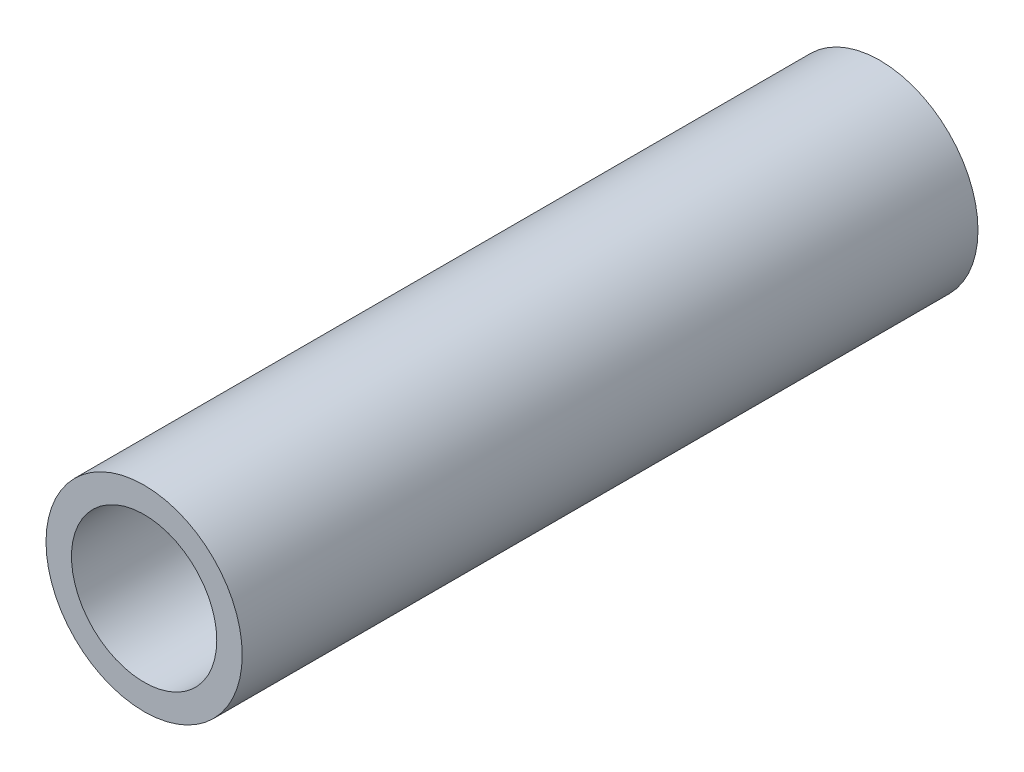
ISO-10303-21;
HEADER;
FILE_DESCRIPTION(('STEP AP214'),'2;1');
FILE_NAME('part.step','',(''),(''),'','','');
FILE_SCHEMA(('AUTOMOTIVE_DESIGN { 1 0 10303 214 1 1 1 1 }'));
ENDSEC;
DATA;
#1=APPLICATION_CONTEXT('core data for automotive mechanical design processes');
#2=APPLICATION_PROTOCOL_DEFINITION('international standard','automotive_design',2000,#1);
#3=PRODUCT_CONTEXT('',#1,'mechanical');
#4=PRODUCT('Part','Part','',(#3));
#5=PRODUCT_RELATED_PRODUCT_CATEGORY('part','',(#4));
#6=PRODUCT_DEFINITION_FORMATION('','',#4);
#7=PRODUCT_DEFINITION_CONTEXT('part definition',#1,'design');
#8=PRODUCT_DEFINITION('design','',#6,#7);
#9=PRODUCT_DEFINITION_SHAPE('','',#8);
#10=(LENGTH_UNIT() NAMED_UNIT(*) SI_UNIT(.MILLI.,.METRE.));
#11=(NAMED_UNIT(*) PLANE_ANGLE_UNIT() SI_UNIT($,.RADIAN.));
#12=(NAMED_UNIT(*) SI_UNIT($,.STERADIAN.) SOLID_ANGLE_UNIT());
#13=UNCERTAINTY_MEASURE_WITH_UNIT(LENGTH_MEASURE(1.E-05),#10,'distance_accuracy_value','');
#14=(GEOMETRIC_REPRESENTATION_CONTEXT(3) GLOBAL_UNCERTAINTY_ASSIGNED_CONTEXT((#13)) GLOBAL_UNIT_ASSIGNED_CONTEXT((#10,
#11,#12)) REPRESENTATION_CONTEXT('',''));
#15=CARTESIAN_POINT('',(0.,0.,0.));
#16=DIRECTION('',(0.,0.,1.));
#17=DIRECTION('',(1.,0.,0.));
#18=AXIS2_PLACEMENT_3D('',#15,#16,#17);
#19=CARTESIAN_POINT('',(0.,0.,40.));
#20=DIRECTION('',(0.,0.,1.));
#21=DIRECTION('',(1.,0.,0.));
#22=AXIS2_PLACEMENT_3D('',#19,#20,#21);
#23=PLANE('',#22);
#24=CARTESIAN_POINT('',(0.,0.,40.));
#25=DIRECTION('',(0.,0.,1.));
#26=DIRECTION('',(1.,0.,0.));
#27=AXIS2_PLACEMENT_3D('',#24,#25,#26);
#28=CIRCLE('',#27,10.668);
#29=CARTESIAN_POINT('',(10.668,0.,40.));
#30=VERTEX_POINT('',#29);
#31=EDGE_CURVE('E11',#30,#30,#28,.T.);
#32=ORIENTED_EDGE('',*,*,#31,.T.);
#33=EDGE_LOOP('',(#32));
#34=FACE_BOUND('',#33,.T.);
#35=CARTESIAN_POINT('',(0.,0.,40.));
#36=DIRECTION('',(0.,0.,1.));
#37=DIRECTION('',(1.,0.,0.));
#38=AXIS2_PLACEMENT_3D('',#35,#36,#37);
#39=CIRCLE('',#38,7.8994);
#40=CARTESIAN_POINT('',(7.8994,0.,40.));
#41=VERTEX_POINT('',#40);
#42=EDGE_CURVE('E50',#41,#41,#39,.T.);
#43=ORIENTED_EDGE('',*,*,#42,.F.);
#44=EDGE_LOOP('',(#43));
#45=FACE_BOUND('',#44,.T.);
#46=ADVANCED_FACE('F39',(#34,#45),#23,.T.);
#47=CARTESIAN_POINT('',(0.,0.,-40.));
#48=DIRECTION('',(0.,0.,1.));
#49=DIRECTION('',(1.,0.,0.));
#50=AXIS2_PLACEMENT_3D('',#47,#48,#49);
#51=PLANE('',#50);
#52=CARTESIAN_POINT('',(0.,0.,-40.));
#53=DIRECTION('',(0.,0.,1.));
#54=DIRECTION('',(1.,0.,0.));
#55=AXIS2_PLACEMENT_3D('',#52,#53,#54);
#56=CIRCLE('',#55,10.668);
#57=CARTESIAN_POINT('',(10.668,0.,-40.));
#58=VERTEX_POINT('',#57);
#59=EDGE_CURVE('E43',#58,#58,#56,.T.);
#60=ORIENTED_EDGE('',*,*,#59,.F.);
#61=EDGE_LOOP('',(#60));
#62=FACE_BOUND('',#61,.T.);
#63=CARTESIAN_POINT('',(0.,0.,-40.));
#64=DIRECTION('',(0.,0.,1.));
#65=DIRECTION('',(1.,0.,0.));
#66=AXIS2_PLACEMENT_3D('',#63,#64,#65);
#67=CIRCLE('',#66,7.8994);
#68=CARTESIAN_POINT('',(7.8994,0.,-40.));
#69=VERTEX_POINT('',#68);
#70=EDGE_CURVE('E52',#69,#69,#67,.T.);
#71=ORIENTED_EDGE('',*,*,#70,.T.);
#72=EDGE_LOOP('',(#71));
#73=FACE_BOUND('',#72,.T.);
#74=ADVANCED_FACE('F62',(#62,#73),#51,.F.);
#75=CARTESIAN_POINT('',(0.,0.,40.));
#76=DIRECTION('',(0.,0.,-1.));
#77=DIRECTION('',(-1.,0.,0.));
#78=AXIS2_PLACEMENT_3D('',#75,#76,#77);
#79=CYLINDRICAL_SURFACE('',#78,10.668);
#80=ORIENTED_EDGE('',*,*,#31,.F.);
#81=EDGE_LOOP('',(#80));
#82=FACE_BOUND('',#81,.T.);
#83=ORIENTED_EDGE('',*,*,#59,.T.);
#84=EDGE_LOOP('',(#83));
#85=FACE_BOUND('',#84,.T.);
#86=ADVANCED_FACE('F41',(#82,#85),#79,.T.);
#87=CARTESIAN_POINT('',(0.,0.,40.));
#88=DIRECTION('',(0.,0.,-1.));
#89=DIRECTION('',(-1.,0.,0.));
#90=AXIS2_PLACEMENT_3D('',#87,#88,#89);
#91=CYLINDRICAL_SURFACE('',#90,7.8994);
#92=ORIENTED_EDGE('',*,*,#42,.T.);
#93=EDGE_LOOP('',(#92));
#94=FACE_BOUND('',#93,.T.);
#95=ORIENTED_EDGE('',*,*,#70,.F.);
#96=EDGE_LOOP('',(#95));
#97=FACE_BOUND('',#96,.T.);
#98=ADVANCED_FACE('F58',(#94,#97),#91,.F.);
#99=CLOSED_SHELL('',(#46,#74,#86,#98));
#100=MANIFOLD_SOLID_BREP('B2',#99);
#101=ADVANCED_BREP_SHAPE_REPRESENTATION('',(#18,#100),#14);
#102=SHAPE_DEFINITION_REPRESENTATION(#9,#101);
ENDSEC;
END-ISO-10303-21;
